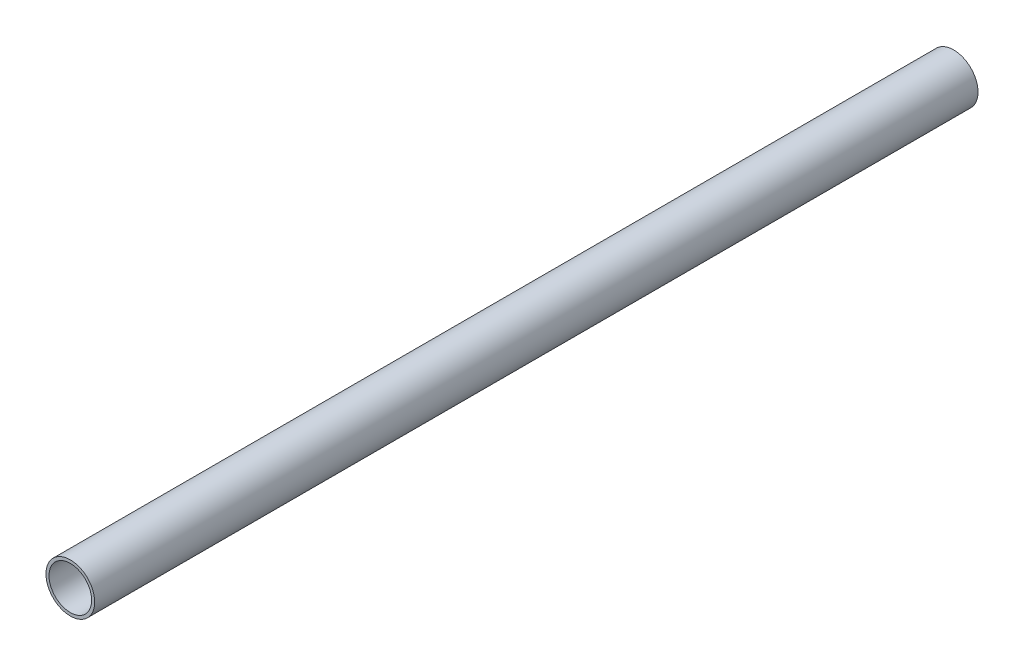
ISO-10303-21;
HEADER;
FILE_DESCRIPTION(('STEP AP214'),'2;1');
FILE_NAME('part.step','',(''),(''),'','','');
FILE_SCHEMA(('AUTOMOTIVE_DESIGN { 1 0 10303 214 1 1 1 1 }'));
ENDSEC;
DATA;
#1=APPLICATION_CONTEXT('core data for automotive mechanical design processes');
#2=APPLICATION_PROTOCOL_DEFINITION('international standard','automotive_design',2000,#1);
#3=PRODUCT_CONTEXT('',#1,'mechanical');
#4=PRODUCT('Part','Part','',(#3));
#5=PRODUCT_RELATED_PRODUCT_CATEGORY('part','',(#4));
#6=PRODUCT_DEFINITION_FORMATION('','',#4);
#7=PRODUCT_DEFINITION_CONTEXT('part definition',#1,'design');
#8=PRODUCT_DEFINITION('design','',#6,#7);
#9=PRODUCT_DEFINITION_SHAPE('','',#8);
#10=(LENGTH_UNIT() NAMED_UNIT(*) SI_UNIT(.MILLI.,.METRE.));
#11=(NAMED_UNIT(*) PLANE_ANGLE_UNIT() SI_UNIT($,.RADIAN.));
#12=(NAMED_UNIT(*) SI_UNIT($,.STERADIAN.) SOLID_ANGLE_UNIT());
#13=UNCERTAINTY_MEASURE_WITH_UNIT(LENGTH_MEASURE(1.E-05),#10,'distance_accuracy_value','');
#14=(GEOMETRIC_REPRESENTATION_CONTEXT(3) GLOBAL_UNCERTAINTY_ASSIGNED_CONTEXT((#13)) GLOBAL_UNIT_ASSIGNED_CONTEXT((#10,
#11,#12)) REPRESENTATION_CONTEXT('',''));
#15=CARTESIAN_POINT('',(0.,0.,0.));
#16=DIRECTION('',(0.,0.,1.));
#17=DIRECTION('',(1.,0.,0.));
#18=AXIS2_PLACEMENT_3D('',#15,#16,#17);
#19=CARTESIAN_POINT('',(0.,0.,-30.));
#20=DIRECTION('',(0.,0.,1.));
#21=DIRECTION('',(1.,0.,0.));
#22=AXIS2_PLACEMENT_3D('',#19,#20,#21);
#23=CYLINDRICAL_SURFACE('',#22,8.);
#24=CARTESIAN_POINT('',(0.,0.,-30.));
#25=DIRECTION('',(0.,0.,1.));
#26=DIRECTION('',(1.,0.,0.));
#27=AXIS2_PLACEMENT_3D('',#24,#25,#26);
#28=CIRCLE('',#27,8.);
#29=CARTESIAN_POINT('',(8.,0.,-30.));
#30=VERTEX_POINT('',#29);
#31=EDGE_CURVE('E10',#30,#30,#28,.T.);
#32=ORIENTED_EDGE('',*,*,#31,.T.);
#33=EDGE_LOOP('',(#32));
#34=FACE_BOUND('',#33,.T.);
#35=CARTESIAN_POINT('',(0.,0.,260.));
#36=DIRECTION('',(0.,0.,1.));
#37=DIRECTION('',(1.,0.,0.));
#38=AXIS2_PLACEMENT_3D('',#35,#36,#37);
#39=CIRCLE('',#38,8.);
#40=CARTESIAN_POINT('',(8.,0.,260.));
#41=VERTEX_POINT('',#40);
#42=EDGE_CURVE('E42',#41,#41,#39,.T.);
#43=ORIENTED_EDGE('',*,*,#42,.F.);
#44=EDGE_LOOP('',(#43));
#45=FACE_BOUND('',#44,.T.);
#46=ADVANCED_FACE('F32',(#34,#45),#23,.T.);
#47=CARTESIAN_POINT('',(0.,0.,-30.));
#48=DIRECTION('',(0.,0.,1.));
#49=DIRECTION('',(1.,0.,0.));
#50=AXIS2_PLACEMENT_3D('',#47,#48,#49);
#51=PLANE('',#50);
#52=CARTESIAN_POINT('',(0.,0.,-30.));
#53=DIRECTION('',(0.,0.,1.));
#54=DIRECTION('',(1.,0.,0.));
#55=AXIS2_PLACEMENT_3D('',#52,#53,#54);
#56=CIRCLE('',#55,7.);
#57=CARTESIAN_POINT('',(7.,0.,-30.));
#58=VERTEX_POINT('',#57);
#59=EDGE_CURVE('E38',#58,#58,#56,.T.);
#60=ORIENTED_EDGE('',*,*,#59,.T.);
#61=EDGE_LOOP('',(#60));
#62=FACE_BOUND('',#61,.T.);
#63=ORIENTED_EDGE('',*,*,#31,.F.);
#64=EDGE_LOOP('',(#63));
#65=FACE_BOUND('',#64,.T.);
#66=ADVANCED_FACE('F61',(#62,#65),#51,.F.);
#67=CARTESIAN_POINT('',(0.,0.,-30.));
#68=DIRECTION('',(0.,0.,1.));
#69=DIRECTION('',(1.,0.,0.));
#70=AXIS2_PLACEMENT_3D('',#67,#68,#69);
#71=CYLINDRICAL_SURFACE('',#70,7.);
#72=ORIENTED_EDGE('',*,*,#59,.F.);
#73=EDGE_LOOP('',(#72));
#74=FACE_BOUND('',#73,.T.);
#75=CARTESIAN_POINT('',(0.,0.,260.));
#76=DIRECTION('',(0.,0.,1.));
#77=DIRECTION('',(1.,0.,0.));
#78=AXIS2_PLACEMENT_3D('',#75,#76,#77);
#79=CIRCLE('',#78,7.);
#80=CARTESIAN_POINT('',(7.,0.,260.));
#81=VERTEX_POINT('',#80);
#82=EDGE_CURVE('E46',#81,#81,#79,.T.);
#83=ORIENTED_EDGE('',*,*,#82,.T.);
#84=EDGE_LOOP('',(#83));
#85=FACE_BOUND('',#84,.T.);
#86=ADVANCED_FACE('F52',(#74,#85),#71,.F.);
#87=CARTESIAN_POINT('',(0.,0.,260.));
#88=DIRECTION('',(0.,0.,1.));
#89=DIRECTION('',(1.,0.,0.));
#90=AXIS2_PLACEMENT_3D('',#87,#88,#89);
#91=PLANE('',#90);
#92=ORIENTED_EDGE('',*,*,#42,.T.);
#93=EDGE_LOOP('',(#92));
#94=FACE_BOUND('',#93,.T.);
#95=ORIENTED_EDGE('',*,*,#82,.F.);
#96=EDGE_LOOP('',(#95));
#97=FACE_BOUND('',#96,.T.);
#98=ADVANCED_FACE('F54',(#94,#97),#91,.T.);
#99=CLOSED_SHELL('',(#46,#66,#86,#98));
#100=MANIFOLD_SOLID_BREP('B2',#99);
#101=ADVANCED_BREP_SHAPE_REPRESENTATION('',(#18,#100),#14);
#102=SHAPE_DEFINITION_REPRESENTATION(#9,#101);
ENDSEC;
END-ISO-10303-21;
